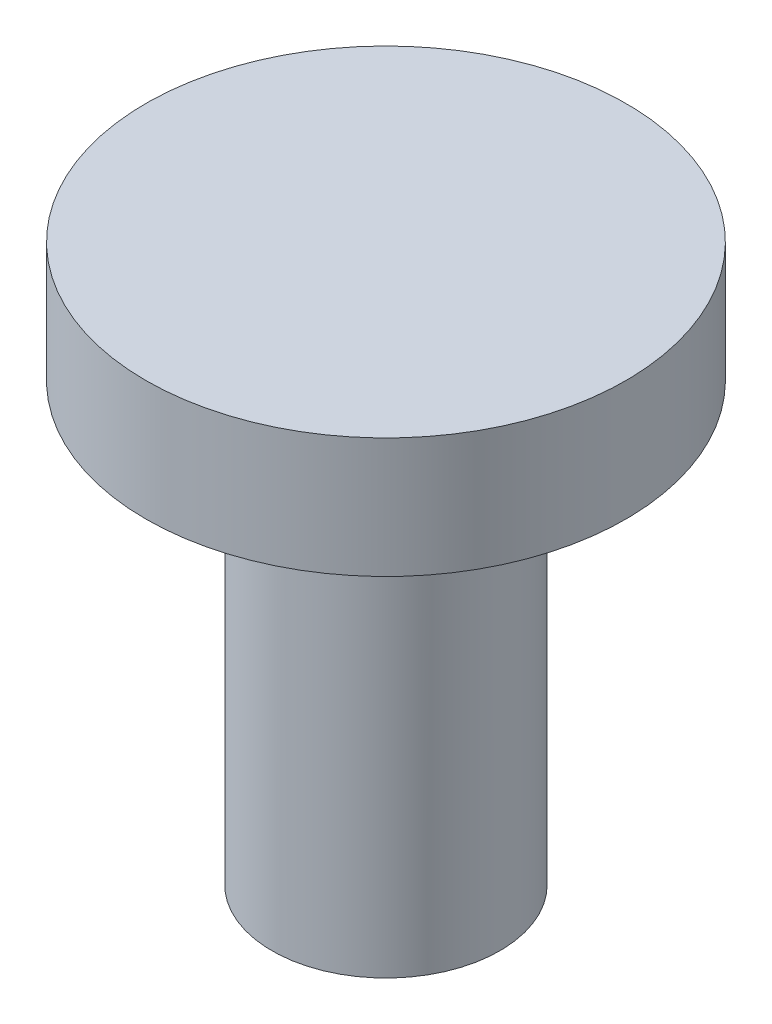
ISO-10303-21;
HEADER;
FILE_DESCRIPTION(('STEP AP214'),'2;1');
FILE_NAME('part.step','',(''),(''),'','','');
FILE_SCHEMA(('AUTOMOTIVE_DESIGN { 1 0 10303 214 1 1 1 1 }'));
ENDSEC;
DATA;
#1=APPLICATION_CONTEXT('core data for automotive mechanical design processes');
#2=APPLICATION_PROTOCOL_DEFINITION('international standard','automotive_design',2000,#1);
#3=PRODUCT_CONTEXT('',#1,'mechanical');
#4=PRODUCT('Part','Part','',(#3));
#5=PRODUCT_RELATED_PRODUCT_CATEGORY('part','',(#4));
#6=PRODUCT_DEFINITION_FORMATION('','',#4);
#7=PRODUCT_DEFINITION_CONTEXT('part definition',#1,'design');
#8=PRODUCT_DEFINITION('design','',#6,#7);
#9=PRODUCT_DEFINITION_SHAPE('','',#8);
#10=(LENGTH_UNIT() NAMED_UNIT(*) SI_UNIT(.MILLI.,.METRE.));
#11=(NAMED_UNIT(*) PLANE_ANGLE_UNIT() SI_UNIT($,.RADIAN.));
#12=(NAMED_UNIT(*) SI_UNIT($,.STERADIAN.) SOLID_ANGLE_UNIT());
#13=UNCERTAINTY_MEASURE_WITH_UNIT(LENGTH_MEASURE(1.E-05),#10,'distance_accuracy_value','');
#14=(GEOMETRIC_REPRESENTATION_CONTEXT(3) GLOBAL_UNCERTAINTY_ASSIGNED_CONTEXT((#13)) GLOBAL_UNIT_ASSIGNED_CONTEXT((#10,
#11,#12)) REPRESENTATION_CONTEXT('',''));
#15=CARTESIAN_POINT('',(0.,0.,0.));
#16=DIRECTION('',(0.,0.,1.));
#17=DIRECTION('',(1.,0.,0.));
#18=AXIS2_PLACEMENT_3D('',#15,#16,#17);
#19=CARTESIAN_POINT('',(0.,10.,0.));
#20=DIRECTION('',(0.,-1.,0.));
#21=DIRECTION('',(0.,0.,-1.));
#22=AXIS2_PLACEMENT_3D('',#19,#20,#21);
#23=CYLINDRICAL_SURFACE('',#22,4.75);
#24=CARTESIAN_POINT('',(0.,10.,0.));
#25=DIRECTION('',(0.,1.,0.));
#26=DIRECTION('',(0.,0.,1.));
#27=AXIS2_PLACEMENT_3D('',#24,#25,#26);
#28=CIRCLE('',#27,4.75);
#29=CARTESIAN_POINT('',(0.,10.,4.75));
#30=VERTEX_POINT('',#29);
#31=EDGE_CURVE('E10',#30,#30,#28,.T.);
#32=ORIENTED_EDGE('',*,*,#31,.F.);
#33=EDGE_LOOP('',(#32));
#34=FACE_BOUND('',#33,.T.);
#35=CARTESIAN_POINT('',(0.,-8.2,0.));
#36=DIRECTION('',(0.,-1.,0.));
#37=DIRECTION('',(0.,0.,-1.));
#38=AXIS2_PLACEMENT_3D('',#35,#36,#37);
#39=CIRCLE('',#38,4.75);
#40=CARTESIAN_POINT('',(0.,-8.2,-4.75));
#41=VERTEX_POINT('',#40);
#42=EDGE_CURVE('E51',#41,#41,#39,.T.);
#43=ORIENTED_EDGE('',*,*,#42,.F.);
#44=EDGE_LOOP('',(#43));
#45=FACE_BOUND('',#44,.T.);
#46=ADVANCED_FACE('F36',(#34,#45),#23,.T.);
#47=CARTESIAN_POINT('',(0.,15.,0.));
#48=DIRECTION('',(0.,-1.,0.));
#49=DIRECTION('',(0.,0.,-1.));
#50=AXIS2_PLACEMENT_3D('',#47,#48,#49);
#51=CYLINDRICAL_SURFACE('',#50,10.);
#52=CARTESIAN_POINT('',(0.,15.,0.));
#53=DIRECTION('',(0.,1.,0.));
#54=DIRECTION('',(0.,0.,1.));
#55=AXIS2_PLACEMENT_3D('',#52,#53,#54);
#56=CIRCLE('',#55,10.);
#57=CARTESIAN_POINT('',(0.,15.,10.));
#58=VERTEX_POINT('',#57);
#59=EDGE_CURVE('E42',#58,#58,#56,.T.);
#60=ORIENTED_EDGE('',*,*,#59,.F.);
#61=EDGE_LOOP('',(#60));
#62=FACE_BOUND('',#61,.T.);
#63=CARTESIAN_POINT('',(0.,10.,0.));
#64=DIRECTION('',(0.,1.,0.));
#65=DIRECTION('',(0.,0.,1.));
#66=AXIS2_PLACEMENT_3D('',#63,#64,#65);
#67=CIRCLE('',#66,10.);
#68=CARTESIAN_POINT('',(0.,10.,10.));
#69=VERTEX_POINT('',#68);
#70=EDGE_CURVE('E46',#69,#69,#67,.T.);
#71=ORIENTED_EDGE('',*,*,#70,.T.);
#72=EDGE_LOOP('',(#71));
#73=FACE_BOUND('',#72,.T.);
#74=ADVANCED_FACE('F59',(#62,#73),#51,.T.);
#75=CARTESIAN_POINT('',(0.,15.,0.));
#76=DIRECTION('',(0.,1.,0.));
#77=DIRECTION('',(0.,0.,1.));
#78=AXIS2_PLACEMENT_3D('',#75,#76,#77);
#79=PLANE('',#78);
#80=ORIENTED_EDGE('',*,*,#59,.T.);
#81=EDGE_LOOP('',(#80));
#82=FACE_BOUND('',#81,.T.);
#83=ADVANCED_FACE('F64',(#82),#79,.T.);
#84=CARTESIAN_POINT('',(0.,10.,0.));
#85=DIRECTION('',(0.,1.,0.));
#86=DIRECTION('',(0.,0.,1.));
#87=AXIS2_PLACEMENT_3D('',#84,#85,#86);
#88=PLANE('',#87);
#89=ORIENTED_EDGE('',*,*,#31,.T.);
#90=EDGE_LOOP('',(#89));
#91=FACE_BOUND('',#90,.T.);
#92=ORIENTED_EDGE('',*,*,#70,.F.);
#93=EDGE_LOOP('',(#92));
#94=FACE_BOUND('',#93,.T.);
#95=ADVANCED_FACE('F69',(#91,#94),#88,.F.);
#96=CARTESIAN_POINT('',(0.,-8.2,0.));
#97=DIRECTION('',(0.,-1.,0.));
#98=DIRECTION('',(0.,0.,-1.));
#99=AXIS2_PLACEMENT_3D('',#96,#97,#98);
#100=PLANE('',#99);
#101=ORIENTED_EDGE('',*,*,#42,.T.);
#102=EDGE_LOOP('',(#101));
#103=FACE_BOUND('',#102,.T.);
#104=ADVANCED_FACE('F56',(#103),#100,.T.);
#105=CLOSED_SHELL('',(#46,#74,#83,#95,#104));
#106=MANIFOLD_SOLID_BREP('B2',#105);
#107=ADVANCED_BREP_SHAPE_REPRESENTATION('',(#18,#106),#14);
#108=SHAPE_DEFINITION_REPRESENTATION(#9,#107);
ENDSEC;
END-ISO-10303-21;
